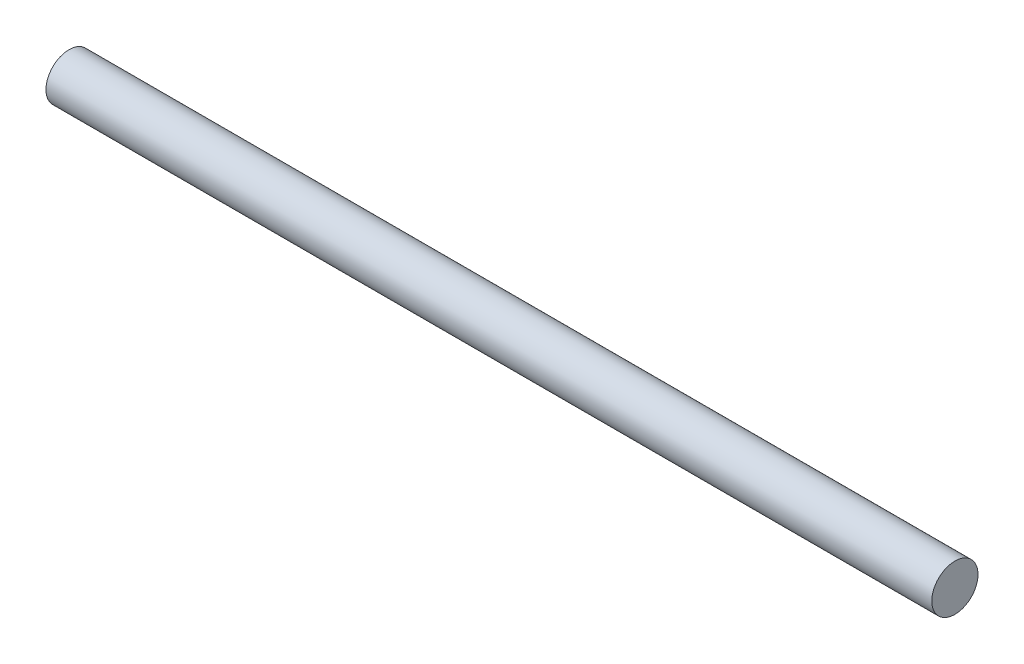
ISO-10303-21;
HEADER;
FILE_DESCRIPTION(('STEP AP214'),'2;1');
FILE_NAME('part.step','',(''),(''),'','','');
FILE_SCHEMA(('AUTOMOTIVE_DESIGN { 1 0 10303 214 1 1 1 1 }'));
ENDSEC;
DATA;
#1=APPLICATION_CONTEXT('core data for automotive mechanical design processes');
#2=APPLICATION_PROTOCOL_DEFINITION('international standard','automotive_design',2000,#1);
#3=PRODUCT_CONTEXT('',#1,'mechanical');
#4=PRODUCT('Part','Part','',(#3));
#5=PRODUCT_RELATED_PRODUCT_CATEGORY('part','',(#4));
#6=PRODUCT_DEFINITION_FORMATION('','',#4);
#7=PRODUCT_DEFINITION_CONTEXT('part definition',#1,'design');
#8=PRODUCT_DEFINITION('design','',#6,#7);
#9=PRODUCT_DEFINITION_SHAPE('','',#8);
#10=(LENGTH_UNIT() NAMED_UNIT(*) SI_UNIT(.MILLI.,.METRE.));
#11=(NAMED_UNIT(*) PLANE_ANGLE_UNIT() SI_UNIT($,.RADIAN.));
#12=(NAMED_UNIT(*) SI_UNIT($,.STERADIAN.) SOLID_ANGLE_UNIT());
#13=UNCERTAINTY_MEASURE_WITH_UNIT(LENGTH_MEASURE(1.E-05),#10,'distance_accuracy_value','');
#14=(GEOMETRIC_REPRESENTATION_CONTEXT(3) GLOBAL_UNCERTAINTY_ASSIGNED_CONTEXT((#13)) GLOBAL_UNIT_ASSIGNED_CONTEXT((#10,
#11,#12)) REPRESENTATION_CONTEXT('',''));
#15=CARTESIAN_POINT('',(0.,0.,0.));
#16=DIRECTION('',(0.,0.,1.));
#17=DIRECTION('',(1.,0.,0.));
#18=AXIS2_PLACEMENT_3D('',#15,#16,#17);
#19=CARTESIAN_POINT('',(-125.,0.,0.));
#20=DIRECTION('',(1.,0.,0.));
#21=DIRECTION('',(0.,0.,-1.));
#22=AXIS2_PLACEMENT_3D('',#19,#20,#21);
#23=CYLINDRICAL_SURFACE('',#22,6.5229884952349);
#24=CARTESIAN_POINT('',(-125.,0.,0.));
#25=DIRECTION('',(1.,0.,0.));
#26=DIRECTION('',(0.,0.,-1.));
#27=AXIS2_PLACEMENT_3D('',#24,#25,#26);
#28=CIRCLE('',#27,6.5229884952349);
#29=CARTESIAN_POINT('',(-125.,0.,-6.5229884952349));
#30=VERTEX_POINT('',#29);
#31=EDGE_CURVE('E10',#30,#30,#28,.T.);
#32=ORIENTED_EDGE('',*,*,#31,.T.);
#33=EDGE_LOOP('',(#32));
#34=FACE_BOUND('',#33,.T.);
#35=CARTESIAN_POINT('',(125.,0.,0.));
#36=DIRECTION('',(1.,0.,0.));
#37=DIRECTION('',(0.,0.,-1.));
#38=AXIS2_PLACEMENT_3D('',#35,#36,#37);
#39=CIRCLE('',#38,6.5229884952349);
#40=CARTESIAN_POINT('',(125.,0.,-6.5229884952349));
#41=VERTEX_POINT('',#40);
#42=EDGE_CURVE('E37',#41,#41,#39,.T.);
#43=ORIENTED_EDGE('',*,*,#42,.F.);
#44=EDGE_LOOP('',(#43));
#45=FACE_BOUND('',#44,.T.);
#46=ADVANCED_FACE('F31',(#34,#45),#23,.T.);
#47=CARTESIAN_POINT('',(-125.,0.,0.));
#48=DIRECTION('',(1.,0.,0.));
#49=DIRECTION('',(0.,0.,-1.));
#50=AXIS2_PLACEMENT_3D('',#47,#48,#49);
#51=PLANE('',#50);
#52=ORIENTED_EDGE('',*,*,#31,.F.);
#53=EDGE_LOOP('',(#52));
#54=FACE_BOUND('',#53,.T.);
#55=ADVANCED_FACE('F46',(#54),#51,.F.);
#56=CARTESIAN_POINT('',(125.,0.,0.));
#57=DIRECTION('',(1.,0.,0.));
#58=DIRECTION('',(0.,0.,-1.));
#59=AXIS2_PLACEMENT_3D('',#56,#57,#58);
#60=PLANE('',#59);
#61=ORIENTED_EDGE('',*,*,#42,.T.);
#62=EDGE_LOOP('',(#61));
#63=FACE_BOUND('',#62,.T.);
#64=ADVANCED_FACE('F43',(#63),#60,.T.);
#65=CLOSED_SHELL('',(#46,#55,#64));
#66=MANIFOLD_SOLID_BREP('B2',#65);
#67=ADVANCED_BREP_SHAPE_REPRESENTATION('',(#18,#66),#14);
#68=SHAPE_DEFINITION_REPRESENTATION(#9,#67);
ENDSEC;
END-ISO-10303-21;
